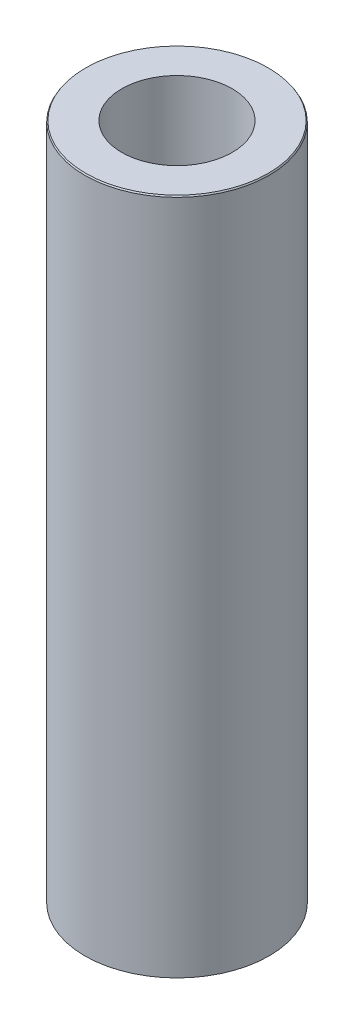
ISO-10303-21;
HEADER;
FILE_DESCRIPTION(('STEP AP214'),'2;1');
FILE_NAME('part.step','',(''),(''),'','','');
FILE_SCHEMA(('AUTOMOTIVE_DESIGN { 1 0 10303 214 1 1 1 1 }'));
ENDSEC;
DATA;
#1=APPLICATION_CONTEXT('core data for automotive mechanical design processes');
#2=APPLICATION_PROTOCOL_DEFINITION('international standard','automotive_design',2000,#1);
#3=PRODUCT_CONTEXT('',#1,'mechanical');
#4=PRODUCT('Part','Part','',(#3));
#5=PRODUCT_RELATED_PRODUCT_CATEGORY('part','',(#4));
#6=PRODUCT_DEFINITION_FORMATION('','',#4);
#7=PRODUCT_DEFINITION_CONTEXT('part definition',#1,'design');
#8=PRODUCT_DEFINITION('design','',#6,#7);
#9=PRODUCT_DEFINITION_SHAPE('','',#8);
#10=(LENGTH_UNIT() NAMED_UNIT(*) SI_UNIT(.MILLI.,.METRE.));
#11=(NAMED_UNIT(*) PLANE_ANGLE_UNIT() SI_UNIT($,.RADIAN.));
#12=(NAMED_UNIT(*) SI_UNIT($,.STERADIAN.) SOLID_ANGLE_UNIT());
#13=UNCERTAINTY_MEASURE_WITH_UNIT(LENGTH_MEASURE(1.E-05),#10,'distance_accuracy_value','');
#14=(GEOMETRIC_REPRESENTATION_CONTEXT(3) GLOBAL_UNCERTAINTY_ASSIGNED_CONTEXT((#13)) GLOBAL_UNIT_ASSIGNED_CONTEXT((#10,
#11,#12)) REPRESENTATION_CONTEXT('',''));
#15=CARTESIAN_POINT('',(0.,0.,0.));
#16=DIRECTION('',(0.,0.,1.));
#17=DIRECTION('',(1.,0.,0.));
#18=AXIS2_PLACEMENT_3D('',#15,#16,#17);
#19=CARTESIAN_POINT('',(0.,386.265184714358,0.));
#20=DIRECTION('',(0.,-1.,0.));
#21=DIRECTION('',(0.,0.,-1.));
#22=AXIS2_PLACEMENT_3D('',#19,#20,#21);
#23=CYLINDRICAL_SURFACE('',#22,52.5);
#24=CARTESIAN_POINT('',(0.,385.490931752461,0.));
#25=DIRECTION('',(0.,1.,0.));
#26=DIRECTION('',(0.,0.,1.));
#27=AXIS2_PLACEMENT_3D('',#24,#25,#26);
#28=CIRCLE('',#27,52.5);
#29=CARTESIAN_POINT('',(0.,385.490931752461,-52.5));
#30=VERTEX_POINT('',#29);
#31=EDGE_CURVE('E50',#30,#30,#28,.F.);
#32=CARTESIAN_POINT('',(0.,0.481087072478459,0.));
#33=DIRECTION('',(0.,1.,0.));
#34=DIRECTION('',(0.,0.,1.));
#35=AXIS2_PLACEMENT_3D('',#32,#33,#34);
#36=CIRCLE('',#35,52.5);
#37=CARTESIAN_POINT('',(0.,0.481087072478403,-52.5));
#38=VERTEX_POINT('',#37);
#39=EDGE_CURVE('E51',#38,#38,#36,.T.);
#40=CARTESIAN_POINT('',(0.,385.490931752461,-52.5));
#41=CARTESIAN_POINT('',(0.,381.480412537044,-52.5));
#42=CARTESIAN_POINT('',(0.,377.469893321628,-52.5));
#43=CARTESIAN_POINT('',(0.,369.448854890795,-52.5));
#44=CARTESIAN_POINT('',(0.,365.438335675378,-52.5));
#45=CARTESIAN_POINT('',(0.,357.417297244545,-52.5));
#46=CARTESIAN_POINT('',(0.,353.406778029129,-52.5));
#47=CARTESIAN_POINT('',(0.,345.385739598296,-52.5));
#48=CARTESIAN_POINT('',(0.,341.375220382879,-52.5));
#49=CARTESIAN_POINT('',(0.,333.354181952046,-52.5));
#50=CARTESIAN_POINT('',(0.,329.34366273663,-52.5));
#51=CARTESIAN_POINT('',(0.,321.322624305797,-52.5));
#52=CARTESIAN_POINT('',(0.,317.31210509038,-52.5));
#53=CARTESIAN_POINT('',(0.,309.291066659548,-52.5));
#54=CARTESIAN_POINT('',(0.,305.280547444131,-52.5));
#55=CARTESIAN_POINT('',(0.,297.259509013298,-52.5));
#56=CARTESIAN_POINT('',(0.,293.248989797882,-52.5));
#57=CARTESIAN_POINT('',(0.,285.227951367049,-52.5));
#58=CARTESIAN_POINT('',(0.,281.217432151632,-52.5));
#59=CARTESIAN_POINT('',(0.,273.196393720799,-52.5));
#60=CARTESIAN_POINT('',(0.,269.185874505383,-52.5));
#61=CARTESIAN_POINT('',(0.,261.16483607455,-52.5));
#62=CARTESIAN_POINT('',(0.,257.154316859133,-52.5));
#63=CARTESIAN_POINT('',(0.,249.1332784283,-52.5));
#64=CARTESIAN_POINT('',(0.,245.122759212884,-52.5));
#65=CARTESIAN_POINT('',(0.,237.101720782051,-52.5));
#66=CARTESIAN_POINT('',(0.,233.091201566634,-52.5));
#67=CARTESIAN_POINT('',(0.,225.070163135801,-52.5));
#68=CARTESIAN_POINT('',(0.,221.059643920385,-52.5));
#69=CARTESIAN_POINT('',(0.,213.038605489552,-52.5));
#70=CARTESIAN_POINT('',(0.,209.028086274135,-52.5));
#71=CARTESIAN_POINT('',(0.,201.007047843303,-52.5));
#72=CARTESIAN_POINT('',(0.,196.996528627886,-52.5));
#73=CARTESIAN_POINT('',(0.,188.975490197053,-52.5));
#74=CARTESIAN_POINT('',(0.,184.964970981637,-52.5));
#75=CARTESIAN_POINT('',(0.,176.943932550804,-52.5));
#76=CARTESIAN_POINT('',(0.,172.933413335387,-52.5));
#77=CARTESIAN_POINT('',(0.,164.912374904554,-52.5));
#78=CARTESIAN_POINT('',(0.,160.901855689138,-52.5));
#79=CARTESIAN_POINT('',(0.,152.880817258305,-52.5));
#80=CARTESIAN_POINT('',(0.,148.870298042888,-52.5));
#81=CARTESIAN_POINT('',(0.,140.849259612055,-52.5));
#82=CARTESIAN_POINT('',(0.,136.838740396639,-52.5));
#83=CARTESIAN_POINT('',(0.,128.817701965806,-52.5));
#84=CARTESIAN_POINT('',(0.,124.807182750389,-52.5));
#85=CARTESIAN_POINT('',(0.,116.786144319556,-52.5));
#86=CARTESIAN_POINT('',(0.,112.77562510414,-52.5));
#87=CARTESIAN_POINT('',(0.,104.754586673307,-52.5));
#88=CARTESIAN_POINT('',(0.,100.74406745789,-52.5));
#89=CARTESIAN_POINT('',(0.,92.7230290270575,-52.5));
#90=CARTESIAN_POINT('',(0.,88.712509811641,-52.5));
#91=CARTESIAN_POINT('',(0.,80.6914713808081,-52.5));
#92=CARTESIAN_POINT('',(0.,76.6809521653916,-52.5));
#93=CARTESIAN_POINT('',(0.,68.6599137345586,-52.5));
#94=CARTESIAN_POINT('',(0.,64.6493945191421,-52.5));
#95=CARTESIAN_POINT('',(0.,56.6283560883091,-52.5));
#96=CARTESIAN_POINT('',(0.,52.6178368728927,-52.5));
#97=CARTESIAN_POINT('',(0.,44.5967984420597,-52.5));
#98=CARTESIAN_POINT('',(0.,40.5862792266432,-52.5));
#99=CARTESIAN_POINT('',(0.,32.5652407958103,-52.5));
#100=CARTESIAN_POINT('',(0.,28.5547215803938,-52.5));
#101=CARTESIAN_POINT('',(0.,20.5336831495608,-52.5));
#102=CARTESIAN_POINT('',(0.,16.5231639341443,-52.5));
#103=CARTESIAN_POINT('',(0.,8.50212550331138,-52.5));
#104=CARTESIAN_POINT('',(0.,4.49160628789489,-52.5));
#105=CARTESIAN_POINT('',(0.,0.481087072478403,-52.5));
#106=B_SPLINE_CURVE_WITH_KNOTS('',3,(#40,#41,#42,#43,#44,#45,#46,#47,#48,#49,#50,#51,#52,#53,
#54,#55,#56,#57,#58,#59,#60,#61,#62,#63,#64,#65,#66,#67,#68,#69,#70,#71,#72,#73,#74,#75,#76,#77,
#78,#79,#80,#81,#82,#83,#84,#85,#86,#87,#88,#89,#90,#91,#92,#93,#94,#95,#96,#97,#98,#99,#100,
#101,#102,#103,#104,#105),.UNSPECIFIED.,.F.,.F.,(4,2,2,2,2,2,2,2,2,2,2,2,2,2,2,2,2,2,2,2,2,2,2,
2,2,2,2,2,2,2,2,2,4),(0.,12.0315576462494,24.0631152924989,36.0946729387483,48.1262305849978,
60.1577882312472,72.1893458774966,84.2209035237461,96.2524611699955,108.284018816245,
120.315576462494,132.347134108744,144.378691754993,156.410249401243,168.441807047492,
180.473364693742,192.504922339991,204.536479986241,216.56803763249,228.599595278739,
240.631152924989,252.662710571238,264.694268217488,276.725825863737,288.757383509987,
300.788941156236,312.820498802486,324.852056448735,336.883614094985,348.915171741234,
360.946729387483,372.978287033733,385.009844679982),.UNSPECIFIED.);
#107=EDGE_CURVE('BSEAM39',#30,#38,#106,.T.);
#108=ORIENTED_EDGE('',*,*,#31,.T.);
#109=ORIENTED_EDGE('',*,*,#39,.T.);
#110=ORIENTED_EDGE('',*,*,#107,.T.);
#111=ORIENTED_EDGE('',*,*,#107,.F.);
#112=EDGE_LOOP('',(#108,#110,#109,#111));
#113=FACE_BOUND('',#112,.T.);
#114=ADVANCED_FACE('F39',(#113),#23,.T.);
#115=CARTESIAN_POINT('',(0.,386.265184714358,0.));
#116=DIRECTION('',(0.,1.,0.));
#117=DIRECTION('',(0.,0.,1.));
#118=AXIS2_PLACEMENT_3D('',#115,#116,#117);
#119=PLANE('',#118);
#120=CARTESIAN_POINT('',(0.,386.265184714358,0.));
#121=DIRECTION('',(0.,1.,0.));
#122=DIRECTION('',(0.,0.,1.));
#123=AXIS2_PLACEMENT_3D('',#120,#121,#122);
#124=CIRCLE('',#123,52.018912927522);
#125=CARTESIAN_POINT('',(0.,386.265184714358,52.018912927522));
#126=VERTEX_POINT('',#125);
#127=EDGE_CURVE('E54',#126,#126,#124,.T.);
#128=ORIENTED_EDGE('',*,*,#127,.T.);
#129=EDGE_LOOP('',(#128));
#130=FACE_BOUND('',#129,.T.);
#131=CARTESIAN_POINT('',(0.,386.265184714358,0.));
#132=DIRECTION('',(0.,1.,0.));
#133=DIRECTION('',(0.,0.,1.));
#134=AXIS2_PLACEMENT_3D('',#131,#132,#133);
#135=CIRCLE('',#134,31.4577474509991);
#136=CARTESIAN_POINT('',(0.,386.265184714358,-31.4577474509991));
#137=VERTEX_POINT('',#136);
#138=EDGE_CURVE('E58',#137,#137,#135,.T.);
#139=ORIENTED_EDGE('',*,*,#138,.F.);
#140=EDGE_LOOP('',(#139));
#141=FACE_BOUND('',#140,.T.);
#142=ADVANCED_FACE('F69',(#130,#141),#119,.T.);
#143=CARTESIAN_POINT('',(0.,0.,0.));
#144=DIRECTION('',(0.,1.,0.));
#145=DIRECTION('',(0.,0.,1.));
#146=AXIS2_PLACEMENT_3D('',#143,#144,#145);
#147=PLANE('',#146);
#148=CARTESIAN_POINT('',(0.,0.,0.));
#149=DIRECTION('',(0.,1.,0.));
#150=DIRECTION('',(0.,0.,1.));
#151=AXIS2_PLACEMENT_3D('',#148,#149,#150);
#152=CIRCLE('',#151,51.7257470381021);
#153=CARTESIAN_POINT('',(0.,0.,51.7257470381021));
#154=VERTEX_POINT('',#153);
#155=EDGE_CURVE('E10',#154,#154,#152,.F.);
#156=ORIENTED_EDGE('',*,*,#155,.T.);
#157=EDGE_LOOP('',(#156));
#158=FACE_BOUND('',#157,.T.);
#159=CARTESIAN_POINT('',(0.,0.,0.));
#160=DIRECTION('',(0.,1.,0.));
#161=DIRECTION('',(0.,0.,1.));
#162=AXIS2_PLACEMENT_3D('',#159,#160,#161);
#163=CIRCLE('',#162,31.4577474509991);
#164=CARTESIAN_POINT('',(0.,0.,-31.4577474509991));
#165=VERTEX_POINT('',#164);
#166=EDGE_CURVE('E63',#165,#165,#163,.T.);
#167=ORIENTED_EDGE('',*,*,#166,.T.);
#168=EDGE_LOOP('',(#167));
#169=FACE_BOUND('',#168,.T.);
#170=ADVANCED_FACE('F75',(#158,#169),#147,.F.);
#171=CARTESIAN_POINT('',(0.,386.265184714358,0.));
#172=DIRECTION('',(0.,-1.,0.));
#173=DIRECTION('',(0.,0.,-1.));
#174=AXIS2_PLACEMENT_3D('',#171,#172,#173);
#175=CYLINDRICAL_SURFACE('',#174,31.4577474509991);
#176=CARTESIAN_POINT('',(0.,386.265184714358,-31.4577474509991));
#177=CARTESIAN_POINT('',(0.,382.24158904025,-31.4577474509991));
#178=CARTESIAN_POINT('',(0.,378.217993366142,-31.4577474509991));
#179=CARTESIAN_POINT('',(0.,370.170802017926,-31.4577474509991));
#180=CARTESIAN_POINT('',(0.,366.147206343818,-31.4577474509991));
#181=CARTESIAN_POINT('',(0.,358.100014995603,-31.4577474509991));
#182=CARTESIAN_POINT('',(0.,354.076419321495,-31.4577474509991));
#183=CARTESIAN_POINT('',(0.,346.029227973279,-31.4577474509991));
#184=CARTESIAN_POINT('',(0.,342.005632299171,-31.4577474509991));
#185=CARTESIAN_POINT('',(0.,333.958440950955,-31.4577474509991));
#186=CARTESIAN_POINT('',(0.,329.934845276847,-31.4577474509991));
#187=CARTESIAN_POINT('',(0.,321.887653928632,-31.4577474509991));
#188=CARTESIAN_POINT('',(0.,317.864058254524,-31.4577474509991));
#189=CARTESIAN_POINT('',(0.,309.816866906308,-31.4577474509991));
#190=CARTESIAN_POINT('',(0.,305.7932712322,-31.4577474509991));
#191=CARTESIAN_POINT('',(0.,297.746079883984,-31.4577474509991));
#192=CARTESIAN_POINT('',(0.,293.722484209876,-31.4577474509991));
#193=CARTESIAN_POINT('',(0.,285.675292861661,-31.4577474509991));
#194=CARTESIAN_POINT('',(0.,281.651697187553,-31.4577474509991));
#195=CARTESIAN_POINT('',(0.,273.604505839337,-31.4577474509991));
#196=CARTESIAN_POINT('',(0.,269.580910165229,-31.4577474509991));
#197=CARTESIAN_POINT('',(0.,261.533718817013,-31.4577474509991));
#198=CARTESIAN_POINT('',(0.,257.510123142905,-31.4577474509991));
#199=CARTESIAN_POINT('',(0.,249.462931794689,-31.4577474509991));
#200=CARTESIAN_POINT('',(0.,245.439336120582,-31.4577474509991));
#201=CARTESIAN_POINT('',(0.,237.392144772366,-31.4577474509991));
#202=CARTESIAN_POINT('',(0.,233.368549098258,-31.4577474509991));
#203=CARTESIAN_POINT('',(0.,225.321357750042,-31.4577474509991));
#204=CARTESIAN_POINT('',(0.,221.297762075934,-31.4577474509991));
#205=CARTESIAN_POINT('',(0.,213.250570727718,-31.4577474509991));
#206=CARTESIAN_POINT('',(0.,209.226975053611,-31.4577474509991));
#207=CARTESIAN_POINT('',(0.,201.179783705395,-31.4577474509991));
#208=CARTESIAN_POINT('',(0.,197.156188031287,-31.4577474509991));
#209=CARTESIAN_POINT('',(0.,189.108996683071,-31.4577474509991));
#210=CARTESIAN_POINT('',(0.,185.085401008963,-31.4577474509991));
#211=CARTESIAN_POINT('',(0.,177.038209660747,-31.4577474509991));
#212=CARTESIAN_POINT('',(0.,173.01461398664,-31.4577474509991));
#213=CARTESIAN_POINT('',(0.,164.967422638424,-31.4577474509991));
#214=CARTESIAN_POINT('',(0.,160.943826964316,-31.4577474509991));
#215=CARTESIAN_POINT('',(0.,152.8966356161,-31.4577474509991));
#216=CARTESIAN_POINT('',(0.,148.873039941992,-31.4577474509991));
#217=CARTESIAN_POINT('',(0.,140.825848593776,-31.4577474509991));
#218=CARTESIAN_POINT('',(0.,136.802252919668,-31.4577474509991));
#219=CARTESIAN_POINT('',(0.,128.755061571453,-31.4577474509991));
#220=CARTESIAN_POINT('',(0.,124.731465897345,-31.4577474509991));
#221=CARTESIAN_POINT('',(0.,116.684274549129,-31.4577474509991));
#222=CARTESIAN_POINT('',(0.,112.660678875021,-31.4577474509991));
#223=CARTESIAN_POINT('',(0.,104.613487526805,-31.4577474509991));
#224=CARTESIAN_POINT('',(0.,100.589891852697,-31.4577474509991));
#225=CARTESIAN_POINT('',(0.,92.5427005044816,-31.4577474509991));
#226=CARTESIAN_POINT('',(0.,88.5191048303737,-31.4577474509991));
#227=CARTESIAN_POINT('',(0.,80.4719134821579,-31.4577474509991));
#228=CARTESIAN_POINT('',(0.,76.44831780805,-31.4577474509991));
#229=CARTESIAN_POINT('',(0.,68.4011264598342,-31.4577474509991));
#230=CARTESIAN_POINT('',(0.,64.3775307857263,-31.4577474509991));
#231=CARTESIAN_POINT('',(0.,56.3303394375105,-31.4577474509991));
#232=CARTESIAN_POINT('',(0.,52.3067437634026,-31.4577474509991));
#233=CARTESIAN_POINT('',(0.,44.2595524151869,-31.4577474509991));
#234=CARTESIAN_POINT('',(0.,40.235956741079,-31.4577474509991));
#235=CARTESIAN_POINT('',(0.,32.1887653928632,-31.4577474509991));
#236=CARTESIAN_POINT('',(0.,28.1651697187553,-31.4577474509991));
#237=CARTESIAN_POINT('',(0.,20.1179783705395,-31.4577474509991));
#238=CARTESIAN_POINT('',(0.,16.0943826964316,-31.4577474509991));
#239=CARTESIAN_POINT('',(0.,8.04719134821578,-31.4577474509991));
#240=CARTESIAN_POINT('',(0.,4.02359567410788,-31.4577474509991));
#241=CARTESIAN_POINT('',(0.,0.,-31.4577474509991));
#242=B_SPLINE_CURVE_WITH_KNOTS('',3,(#176,#177,#178,#179,#180,#181,#182,#183,#184,#185,#186,
#187,#188,#189,#190,#191,#192,#193,#194,#195,#196,#197,#198,#199,#200,#201,#202,#203,#204,#205,
#206,#207,#208,#209,#210,#211,#212,#213,#214,#215,#216,#217,#218,#219,#220,#221,#222,#223,#224,
#225,#226,#227,#228,#229,#230,#231,#232,#233,#234,#235,#236,#237,#238,#239,#240,#241),
.UNSPECIFIED.,.F.,.F.,(4,2,2,2,2,2,2,2,2,2,2,2,2,2,2,2,2,2,2,2,2,2,2,2,2,2,2,2,2,2,2,2,4),(0.,
12.0707870223237,24.1415740446473,36.212361066971,48.2831480892947,60.3539351116184,
72.4247221339421,84.4955091562657,96.5662961785895,108.637083200913,120.707870223237,
132.77865724556,144.849444267884,156.920231290208,168.991018312532,181.061805334855,
193.132592357179,205.203379379503,217.274166401826,229.34495342415,241.415740446474,
253.486527468797,265.557314491121,277.628101513445,289.698888535768,301.769675558092,
313.840462580416,325.911249602739,337.982036625063,350.052823647387,362.123610669711,
374.194397692034,386.265184714358),.UNSPECIFIED.);
#243=EDGE_CURVE('BSEAM70',#137,#165,#242,.T.);
#244=ORIENTED_EDGE('',*,*,#138,.T.);
#245=ORIENTED_EDGE('',*,*,#166,.F.);
#246=ORIENTED_EDGE('',*,*,#243,.T.);
#247=ORIENTED_EDGE('',*,*,#243,.F.);
#248=EDGE_LOOP('',(#244,#246,#245,#247));
#249=FACE_BOUND('',#248,.T.);
#250=ADVANCED_FACE('F70',(#249),#175,.F.);
#251=CARTESIAN_POINT('',(0.,386.265184714358,0.));
#252=DIRECTION('',(0.,-1.,0.));
#253=DIRECTION('',(0.,0.,-1.));
#254=AXIS2_PLACEMENT_3D('',#251,#252,#253);
#255=CONICAL_SURFACE('',#254,52.018912927522,0.555974943543025);
#256=ORIENTED_EDGE('',*,*,#31,.F.);
#257=EDGE_LOOP('',(#256));
#258=FACE_BOUND('',#257,.T.);
#259=ORIENTED_EDGE('',*,*,#127,.F.);
#260=EDGE_LOOP('',(#259));
#261=FACE_BOUND('',#260,.T.);
#262=ADVANCED_FACE('F81',(#258,#261),#255,.T.);
#263=CARTESIAN_POINT('',(0.,0.481087072478459,0.));
#264=DIRECTION('',(0.,1.,0.));
#265=DIRECTION('',(0.,0.,1.));
#266=AXIS2_PLACEMENT_3D('',#263,#264,#265);
#267=CONICAL_SURFACE('',#266,52.5,1.01482138325182);
#268=ORIENTED_EDGE('',*,*,#155,.F.);
#269=EDGE_LOOP('',(#268));
#270=FACE_BOUND('',#269,.T.);
#271=ORIENTED_EDGE('',*,*,#39,.F.);
#272=EDGE_LOOP('',(#271));
#273=FACE_BOUND('',#272,.T.);
#274=ADVANCED_FACE('F45',(#270,#273),#267,.T.);
#275=CLOSED_SHELL('',(#114,#142,#170,#250,#262,#274));
#276=MANIFOLD_SOLID_BREP('B2',#275);
#277=ADVANCED_BREP_SHAPE_REPRESENTATION('',(#18,#276),#14);
#278=SHAPE_DEFINITION_REPRESENTATION(#9,#277);
ENDSEC;
END-ISO-10303-21;
